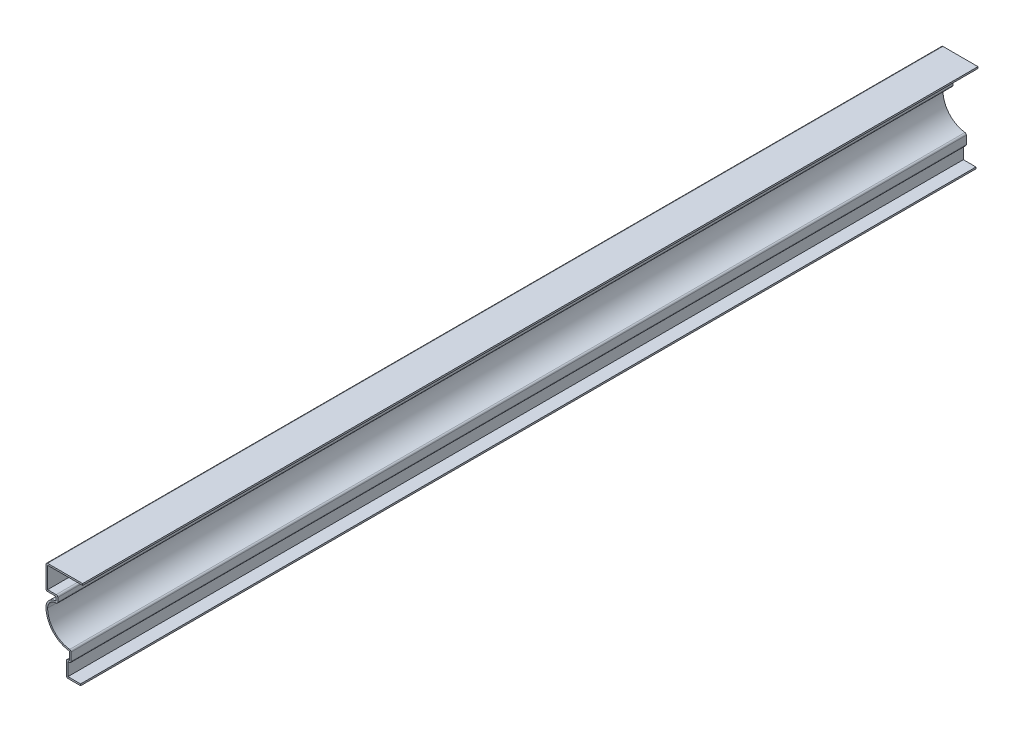
ISO-10303-21;
HEADER;
FILE_DESCRIPTION(('STEP AP214'),'2;1');
FILE_NAME('part.step','',(''),(''),'','','');
FILE_SCHEMA(('AUTOMOTIVE_DESIGN { 1 0 10303 214 1 1 1 1 }'));
ENDSEC;
DATA;
#1=APPLICATION_CONTEXT('core data for automotive mechanical design processes');
#2=APPLICATION_PROTOCOL_DEFINITION('international standard','automotive_design',2000,#1);
#3=PRODUCT_CONTEXT('',#1,'mechanical');
#4=PRODUCT('Part','Part','',(#3));
#5=PRODUCT_RELATED_PRODUCT_CATEGORY('part','',(#4));
#6=PRODUCT_DEFINITION_FORMATION('','',#4);
#7=PRODUCT_DEFINITION_CONTEXT('part definition',#1,'design');
#8=PRODUCT_DEFINITION('design','',#6,#7);
#9=PRODUCT_DEFINITION_SHAPE('','',#8);
#10=(LENGTH_UNIT() NAMED_UNIT(*) SI_UNIT(.MILLI.,.METRE.));
#11=(NAMED_UNIT(*) PLANE_ANGLE_UNIT() SI_UNIT($,.RADIAN.));
#12=(NAMED_UNIT(*) SI_UNIT($,.STERADIAN.) SOLID_ANGLE_UNIT());
#13=UNCERTAINTY_MEASURE_WITH_UNIT(LENGTH_MEASURE(1.E-05),#10,'distance_accuracy_value','');
#14=(GEOMETRIC_REPRESENTATION_CONTEXT(3) GLOBAL_UNCERTAINTY_ASSIGNED_CONTEXT((#13)) GLOBAL_UNIT_ASSIGNED_CONTEXT((#10,
#11,#12)) REPRESENTATION_CONTEXT('',''));
#15=CARTESIAN_POINT('',(0.,0.,0.));
#16=DIRECTION('',(0.,0.,1.));
#17=DIRECTION('',(1.,0.,0.));
#18=AXIS2_PLACEMENT_3D('',#15,#16,#17);
#19=CARTESIAN_POINT('',(-26.9875,68.58,-698.5));
#20=DIRECTION('',(0.,-1.,0.));
#21=DIRECTION('',(0.,0.,-1.));
#22=AXIS2_PLACEMENT_3D('',#19,#20,#21);
#23=PLANE('',#22);
#24=DIRECTION('',(1.,0.,0.));
#25=VECTOR('',#24,1.);
#26=CARTESIAN_POINT('',(-26.9875,68.58,0.));
#27=LINE('',#26,#25);
#28=CARTESIAN_POINT('',(-25.7175,68.58,0.));
#29=VERTEX_POINT('',#28);
#30=CARTESIAN_POINT('',(1.5875,68.58,0.));
#31=VERTEX_POINT('',#30);
#32=EDGE_CURVE('E318',#29,#31,#27,.T.);
#33=ORIENTED_EDGE('',*,*,#32,.F.);
#34=DIRECTION('',(0.,0.,1.));
#35=VECTOR('',#34,1.);
#36=CARTESIAN_POINT('',(-25.7175,68.58,-698.5));
#37=LINE('',#36,#35);
#38=CARTESIAN_POINT('',(-25.7175,68.58,-698.5));
#39=VERTEX_POINT('',#38);
#40=EDGE_CURVE('E265',#39,#29,#37,.T.);
#41=ORIENTED_EDGE('',*,*,#40,.F.);
#42=DIRECTION('',(1.,0.,0.));
#43=VECTOR('',#42,1.);
#44=CARTESIAN_POINT('',(-26.9875,68.58,-698.5));
#45=LINE('',#44,#43);
#46=CARTESIAN_POINT('',(1.5875,68.58,-698.5));
#47=VERTEX_POINT('',#46);
#48=EDGE_CURVE('E247',#39,#47,#45,.T.);
#49=ORIENTED_EDGE('',*,*,#48,.T.);
#50=DIRECTION('',(0.,0.,1.));
#51=VECTOR('',#50,1.);
#52=CARTESIAN_POINT('',(1.5875,68.58,-698.5));
#53=LINE('',#52,#51);
#54=EDGE_CURVE('E255',#47,#31,#53,.T.);
#55=ORIENTED_EDGE('',*,*,#54,.T.);
#56=EDGE_LOOP('',(#33,#41,#49,#55));
#57=FACE_BOUND('',#56,.T.);
#58=ADVANCED_FACE('F43',(#57),#23,.T.);
#59=CARTESIAN_POINT('',(-25.7175,50.8,-698.5));
#60=DIRECTION('',(1.,0.,0.));
#61=DIRECTION('',(0.,0.,-1.));
#62=AXIS2_PLACEMENT_3D('',#59,#60,#61);
#63=PLANE('',#62);
#64=DIRECTION('',(0.,1.,0.));
#65=VECTOR('',#64,1.);
#66=CARTESIAN_POINT('',(-25.7175,50.8,0.));
#67=LINE('',#66,#65);
#68=CARTESIAN_POINT('',(-25.7175,52.07,0.));
#69=VERTEX_POINT('',#68);
#70=EDGE_CURVE('E266',#69,#29,#67,.T.);
#71=ORIENTED_EDGE('',*,*,#70,.F.);
#72=DIRECTION('',(0.,0.,1.));
#73=VECTOR('',#72,1.);
#74=CARTESIAN_POINT('',(-25.7175,52.07,-698.5));
#75=LINE('',#74,#73);
#76=CARTESIAN_POINT('',(-25.7175,52.07,-698.5));
#77=VERTEX_POINT('',#76);
#78=EDGE_CURVE('E369',#77,#69,#75,.T.);
#79=ORIENTED_EDGE('',*,*,#78,.F.);
#80=DIRECTION('',(0.,1.,0.));
#81=VECTOR('',#80,1.);
#82=CARTESIAN_POINT('',(-25.7175,50.8,-698.5));
#83=LINE('',#82,#81);
#84=EDGE_CURVE('E263',#77,#39,#83,.T.);
#85=ORIENTED_EDGE('',*,*,#84,.T.);
#86=ORIENTED_EDGE('',*,*,#40,.T.);
#87=EDGE_LOOP('',(#71,#79,#85,#86));
#88=FACE_BOUND('',#87,.T.);
#89=ADVANCED_FACE('F488',(#88),#63,.T.);
#90=CARTESIAN_POINT('',(-19.05,52.07,-698.5));
#91=DIRECTION('',(0.,1.,0.));
#92=DIRECTION('',(0.,0.,1.));
#93=AXIS2_PLACEMENT_3D('',#90,#91,#92);
#94=PLANE('',#93);
#95=DIRECTION('',(1.,0.,0.));
#96=VECTOR('',#95,1.);
#97=CARTESIAN_POINT('',(-19.05,52.07,0.));
#98=LINE('',#97,#96);
#99=CARTESIAN_POINT('',(-19.05,52.07,0.));
#100=VERTEX_POINT('',#99);
#101=EDGE_CURVE('E269',#100,#69,#98,.F.);
#102=ORIENTED_EDGE('',*,*,#101,.F.);
#103=DIRECTION('',(0.,0.,1.));
#104=VECTOR('',#103,1.);
#105=CARTESIAN_POINT('',(-19.05,52.07,-698.5));
#106=LINE('',#105,#104);
#107=CARTESIAN_POINT('',(-19.05,52.07,-698.5));
#108=VERTEX_POINT('',#107);
#109=EDGE_CURVE('E458',#100,#108,#106,.F.);
#110=ORIENTED_EDGE('',*,*,#109,.T.);
#111=DIRECTION('',(1.,0.,0.));
#112=VECTOR('',#111,1.);
#113=CARTESIAN_POINT('',(-19.05,52.07,-698.5));
#114=LINE('',#113,#112);
#115=EDGE_CURVE('E315',#108,#77,#114,.F.);
#116=ORIENTED_EDGE('',*,*,#115,.T.);
#117=ORIENTED_EDGE('',*,*,#78,.T.);
#118=EDGE_LOOP('',(#102,#110,#116,#117));
#119=FACE_BOUND('',#118,.T.);
#120=ADVANCED_FACE('F597',(#119),#94,.T.);
#121=CARTESIAN_POINT('',(-17.78,47.625,-698.5));
#122=DIRECTION('',(1.,0.,0.));
#123=DIRECTION('',(0.,0.,-1.));
#124=AXIS2_PLACEMENT_3D('',#121,#122,#123);
#125=PLANE('',#124);
#126=DIRECTION('',(0.,1.,0.));
#127=VECTOR('',#126,1.);
#128=CARTESIAN_POINT('',(-17.78,47.625,0.));
#129=LINE('',#128,#127);
#130=CARTESIAN_POINT('',(-17.78,47.625,0.));
#131=VERTEX_POINT('',#130);
#132=CARTESIAN_POINT('',(-17.78,50.8,0.));
#133=VERTEX_POINT('',#132);
#134=EDGE_CURVE('E363',#131,#133,#129,.T.);
#135=ORIENTED_EDGE('',*,*,#134,.F.);
#136=DIRECTION('',(0.,0.,1.));
#137=VECTOR('',#136,1.);
#138=CARTESIAN_POINT('',(-17.78,47.625,-698.5));
#139=LINE('',#138,#137);
#140=CARTESIAN_POINT('',(-17.78,47.625,-698.5));
#141=VERTEX_POINT('',#140);
#142=EDGE_CURVE('E456',#131,#141,#139,.F.);
#143=ORIENTED_EDGE('',*,*,#142,.T.);
#144=DIRECTION('',(0.,1.,0.));
#145=VECTOR('',#144,1.);
#146=CARTESIAN_POINT('',(-17.78,47.625,-698.5));
#147=LINE('',#146,#145);
#148=CARTESIAN_POINT('',(-17.78,50.8,-698.5));
#149=VERTEX_POINT('',#148);
#150=EDGE_CURVE('E312',#141,#149,#147,.T.);
#151=ORIENTED_EDGE('',*,*,#150,.T.);
#152=DIRECTION('',(0.,0.,1.));
#153=VECTOR('',#152,1.);
#154=CARTESIAN_POINT('',(-17.78,50.8,-698.5));
#155=LINE('',#154,#153);
#156=EDGE_CURVE('E453',#149,#133,#155,.T.);
#157=ORIENTED_EDGE('',*,*,#156,.T.);
#158=EDGE_LOOP('',(#135,#143,#151,#157));
#159=FACE_BOUND('',#158,.T.);
#160=ADVANCED_FACE('F499',(#159),#125,.T.);
#161=CARTESIAN_POINT('',(-19.05,39.6875,-698.5));
#162=DIRECTION('',(0.,0.,1.));
#163=DIRECTION('',(1.,0.,0.));
#164=AXIS2_PLACEMENT_3D('',#161,#162,#163);
#165=CYLINDRICAL_SURFACE('',#164,6.6675);
#166=CARTESIAN_POINT('',(-19.05,39.6875,-698.5));
#167=DIRECTION('',(0.,0.,1.));
#168=DIRECTION('',(1.,0.,0.));
#169=AXIS2_PLACEMENT_3D('',#166,#167,#168);
#170=CIRCLE('',#169,6.6675);
#171=CARTESIAN_POINT('',(-25.7175,39.6875,-698.5));
#172=VERTEX_POINT('',#171);
#173=CARTESIAN_POINT('',(-19.05,46.355,-698.5));
#174=VERTEX_POINT('',#173);
#175=EDGE_CURVE('E309',#172,#174,#170,.F.);
#176=ORIENTED_EDGE('',*,*,#175,.T.);
#177=DIRECTION('',(0.,0.,1.));
#178=VECTOR('',#177,1.);
#179=CARTESIAN_POINT('',(-19.05,46.355,-698.5));
#180=LINE('',#179,#178);
#181=CARTESIAN_POINT('',(-19.05,46.355,0.));
#182=VERTEX_POINT('',#181);
#183=EDGE_CURVE('E450',#174,#182,#180,.T.);
#184=ORIENTED_EDGE('',*,*,#183,.T.);
#185=CARTESIAN_POINT('',(-19.05,39.6875,0.));
#186=DIRECTION('',(0.,0.,1.));
#187=DIRECTION('',(1.,0.,0.));
#188=AXIS2_PLACEMENT_3D('',#185,#186,#187);
#189=CIRCLE('',#188,6.6675);
#190=CARTESIAN_POINT('',(-25.7175,39.6875,0.));
#191=VERTEX_POINT('',#190);
#192=EDGE_CURVE('E360',#191,#182,#189,.F.);
#193=ORIENTED_EDGE('',*,*,#192,.F.);
#194=DIRECTION('',(0.,0.,1.));
#195=VECTOR('',#194,1.);
#196=CARTESIAN_POINT('',(-25.7175,39.6875,-698.5));
#197=LINE('',#196,#195);
#198=EDGE_CURVE('E372',#172,#191,#197,.T.);
#199=ORIENTED_EDGE('',*,*,#198,.F.);
#200=EDGE_LOOP('',(#176,#184,#193,#199));
#201=FACE_BOUND('',#200,.T.);
#202=ADVANCED_FACE('F507',(#201),#165,.F.);
#203=CARTESIAN_POINT('',(-6.19470108695653,39.6875,-698.5));
#204=DIRECTION('',(0.,0.,1.));
#205=DIRECTION('',(1.,0.,0.));
#206=AXIS2_PLACEMENT_3D('',#203,#204,#205);
#207=CYLINDRICAL_SURFACE('',#206,19.5227989130435);
#208=CARTESIAN_POINT('',(-6.19470108695653,39.6875,0.));
#209=DIRECTION('',(0.,0.,1.));
#210=DIRECTION('',(1.,0.,0.));
#211=AXIS2_PLACEMENT_3D('',#208,#209,#210);
#212=CIRCLE('',#211,19.5227989130435);
#213=CARTESIAN_POINT('',(-8.57632053941909,20.3105145228216,0.));
#214=VERTEX_POINT('',#213);
#215=EDGE_CURVE('E358',#214,#191,#212,.F.);
#216=ORIENTED_EDGE('',*,*,#215,.F.);
#217=DIRECTION('',(0.,0.,1.));
#218=VECTOR('',#217,1.);
#219=CARTESIAN_POINT('',(-8.57632053941909,20.3105145228216,-698.5));
#220=LINE('',#219,#218);
#221=CARTESIAN_POINT('',(-8.57632053941909,20.3105145228216,-698.5));
#222=VERTEX_POINT('',#221);
#223=EDGE_CURVE('E448',#214,#222,#220,.F.);
#224=ORIENTED_EDGE('',*,*,#223,.T.);
#225=CARTESIAN_POINT('',(-6.19470108695653,39.6875,-698.5));
#226=DIRECTION('',(0.,0.,1.));
#227=DIRECTION('',(1.,0.,0.));
#228=AXIS2_PLACEMENT_3D('',#225,#226,#227);
#229=CIRCLE('',#228,19.5227989130435);
#230=EDGE_CURVE('E307',#222,#172,#229,.F.);
#231=ORIENTED_EDGE('',*,*,#230,.T.);
#232=ORIENTED_EDGE('',*,*,#198,.T.);
#233=EDGE_LOOP('',(#216,#224,#231,#232));
#234=FACE_BOUND('',#233,.T.);
#235=ADVANCED_FACE('F747',(#234),#207,.F.);
#236=CARTESIAN_POINT('',(-7.46125,12.7,-698.5));
#237=DIRECTION('',(1.,0.,0.));
#238=DIRECTION('',(0.,0.,-1.));
#239=AXIS2_PLACEMENT_3D('',#236,#237,#238);
#240=PLANE('',#239);
#241=DIRECTION('',(0.,1.,0.));
#242=VECTOR('',#241,1.);
#243=CARTESIAN_POINT('',(-7.46125,12.7,0.));
#244=LINE('',#243,#242);
#245=CARTESIAN_POINT('',(-7.46125,12.7,0.));
#246=VERTEX_POINT('',#245);
#247=CARTESIAN_POINT('',(-7.46125,19.05,0.));
#248=VERTEX_POINT('',#247);
#249=EDGE_CURVE('E355',#246,#248,#244,.T.);
#250=ORIENTED_EDGE('',*,*,#249,.F.);
#251=DIRECTION('',(0.,0.,1.));
#252=VECTOR('',#251,1.);
#253=CARTESIAN_POINT('',(-7.46125,12.7,-698.5));
#254=LINE('',#253,#252);
#255=CARTESIAN_POINT('',(-7.46125,12.7,-698.5));
#256=VERTEX_POINT('',#255);
#257=EDGE_CURVE('E446',#246,#256,#254,.F.);
#258=ORIENTED_EDGE('',*,*,#257,.T.);
#259=DIRECTION('',(0.,1.,0.));
#260=VECTOR('',#259,1.);
#261=CARTESIAN_POINT('',(-7.46125,12.7,-698.5));
#262=LINE('',#261,#260);
#263=CARTESIAN_POINT('',(-7.46125,19.05,-698.5));
#264=VERTEX_POINT('',#263);
#265=EDGE_CURVE('E304',#256,#264,#262,.T.);
#266=ORIENTED_EDGE('',*,*,#265,.T.);
#267=DIRECTION('',(0.,0.,1.));
#268=VECTOR('',#267,1.);
#269=CARTESIAN_POINT('',(-7.46125,19.05,-698.5));
#270=LINE('',#269,#268);
#271=EDGE_CURVE('E443',#264,#248,#270,.T.);
#272=ORIENTED_EDGE('',*,*,#271,.T.);
#273=EDGE_LOOP('',(#250,#258,#266,#272));
#274=FACE_BOUND('',#273,.T.);
#275=ADVANCED_FACE('F520',(#274),#240,.T.);
#276=CARTESIAN_POINT('',(-11.1125,11.43,-698.5));
#277=DIRECTION('',(0.,-1.,0.));
#278=DIRECTION('',(0.,0.,-1.));
#279=AXIS2_PLACEMENT_3D('',#276,#277,#278);
#280=PLANE('',#279);
#281=DIRECTION('',(1.,0.,0.));
#282=VECTOR('',#281,1.);
#283=CARTESIAN_POINT('',(-11.1125,11.43,-698.5));
#284=LINE('',#283,#282);
#285=CARTESIAN_POINT('',(-9.8425,11.43,-698.5));
#286=VERTEX_POINT('',#285);
#287=CARTESIAN_POINT('',(-8.73125,11.43,-698.5));
#288=VERTEX_POINT('',#287);
#289=EDGE_CURVE('E301',#286,#288,#284,.T.);
#290=ORIENTED_EDGE('',*,*,#289,.T.);
#291=DIRECTION('',(0.,0.,1.));
#292=VECTOR('',#291,1.);
#293=CARTESIAN_POINT('',(-8.73125,11.43,-698.5));
#294=LINE('',#293,#292);
#295=CARTESIAN_POINT('',(-8.73125,11.43,0.));
#296=VERTEX_POINT('',#295);
#297=EDGE_CURVE('E440',#288,#296,#294,.T.);
#298=ORIENTED_EDGE('',*,*,#297,.T.);
#299=DIRECTION('',(1.,0.,0.));
#300=VECTOR('',#299,1.);
#301=CARTESIAN_POINT('',(-11.1125,11.43,0.));
#302=LINE('',#301,#300);
#303=CARTESIAN_POINT('',(-9.8425,11.43,0.));
#304=VERTEX_POINT('',#303);
#305=EDGE_CURVE('E352',#304,#296,#302,.T.);
#306=ORIENTED_EDGE('',*,*,#305,.F.);
#307=DIRECTION('',(0.,0.,1.));
#308=VECTOR('',#307,1.);
#309=CARTESIAN_POINT('',(-9.8425,11.43,-698.5));
#310=LINE('',#309,#308);
#311=EDGE_CURVE('E375',#286,#304,#310,.T.);
#312=ORIENTED_EDGE('',*,*,#311,.F.);
#313=EDGE_LOOP('',(#290,#298,#306,#312));
#314=FACE_BOUND('',#313,.T.);
#315=ADVANCED_FACE('F529',(#314),#280,.T.);
#316=CARTESIAN_POINT('',(-9.8425,0.,-698.5));
#317=DIRECTION('',(1.,0.,0.));
#318=DIRECTION('',(0.,0.,-1.));
#319=AXIS2_PLACEMENT_3D('',#316,#317,#318);
#320=PLANE('',#319);
#321=DIRECTION('',(0.,1.,0.));
#322=VECTOR('',#321,1.);
#323=CARTESIAN_POINT('',(-9.8425,0.,0.));
#324=LINE('',#323,#322);
#325=CARTESIAN_POINT('',(-9.8425,1.27,0.));
#326=VERTEX_POINT('',#325);
#327=EDGE_CURVE('E349',#326,#304,#324,.T.);
#328=ORIENTED_EDGE('',*,*,#327,.F.);
#329=DIRECTION('',(0.,0.,1.));
#330=VECTOR('',#329,1.);
#331=CARTESIAN_POINT('',(-9.8425,1.27,-698.5));
#332=LINE('',#331,#330);
#333=CARTESIAN_POINT('',(-9.8425,1.27,-698.5));
#334=VERTEX_POINT('',#333);
#335=EDGE_CURVE('E377',#334,#326,#332,.T.);
#336=ORIENTED_EDGE('',*,*,#335,.F.);
#337=DIRECTION('',(0.,1.,0.));
#338=VECTOR('',#337,1.);
#339=CARTESIAN_POINT('',(-9.8425,0.,-698.5));
#340=LINE('',#339,#338);
#341=EDGE_CURVE('E298',#334,#286,#340,.T.);
#342=ORIENTED_EDGE('',*,*,#341,.T.);
#343=ORIENTED_EDGE('',*,*,#311,.T.);
#344=EDGE_LOOP('',(#328,#336,#342,#343));
#345=FACE_BOUND('',#344,.T.);
#346=ADVANCED_FACE('F535',(#345),#320,.T.);
#347=CARTESIAN_POINT('',(0.,1.27,-698.5));
#348=DIRECTION('',(0.,1.,0.));
#349=DIRECTION('',(0.,0.,1.));
#350=AXIS2_PLACEMENT_3D('',#347,#348,#349);
#351=PLANE('',#350);
#352=DIRECTION('',(1.,0.,0.));
#353=VECTOR('',#352,1.);
#354=CARTESIAN_POINT('',(0.,1.27,0.));
#355=LINE('',#354,#353);
#356=CARTESIAN_POINT('',(0.,1.27,0.));
#357=VERTEX_POINT('',#356);
#358=EDGE_CURVE('E346',#357,#326,#355,.F.);
#359=ORIENTED_EDGE('',*,*,#358,.F.);
#360=DIRECTION('',(0.,0.,1.));
#361=VECTOR('',#360,1.);
#362=CARTESIAN_POINT('',(0.,1.27,-698.5));
#363=LINE('',#362,#361);
#364=CARTESIAN_POINT('',(0.,1.27,-698.5));
#365=VERTEX_POINT('',#364);
#366=EDGE_CURVE('E379',#365,#357,#363,.T.);
#367=ORIENTED_EDGE('',*,*,#366,.F.);
#368=DIRECTION('',(1.,0.,0.));
#369=VECTOR('',#368,1.);
#370=CARTESIAN_POINT('',(0.,1.27,-698.5));
#371=LINE('',#370,#369);
#372=EDGE_CURVE('E295',#365,#334,#371,.F.);
#373=ORIENTED_EDGE('',*,*,#372,.T.);
#374=ORIENTED_EDGE('',*,*,#335,.T.);
#375=EDGE_LOOP('',(#359,#367,#373,#374));
#376=FACE_BOUND('',#375,.T.);
#377=ADVANCED_FACE('F538',(#376),#351,.T.);
#378=CARTESIAN_POINT('',(0.,1.27,-698.5));
#379=DIRECTION('',(-1.,0.,0.));
#380=DIRECTION('',(0.,0.,1.));
#381=AXIS2_PLACEMENT_3D('',#378,#379,#380);
#382=PLANE('',#381);
#383=DIRECTION('',(0.,-1.,0.));
#384=VECTOR('',#383,1.);
#385=CARTESIAN_POINT('',(0.,1.27,0.));
#386=LINE('',#385,#384);
#387=CARTESIAN_POINT('',(0.,0.,0.));
#388=VERTEX_POINT('',#387);
#389=EDGE_CURVE('E344',#357,#388,#386,.T.);
#390=ORIENTED_EDGE('',*,*,#389,.T.);
#391=DIRECTION('',(0.,0.,1.));
#392=VECTOR('',#391,1.);
#393=CARTESIAN_POINT('',(0.,0.,-698.5));
#394=LINE('',#393,#392);
#395=CARTESIAN_POINT('',(0.,0.,-698.5));
#396=VERTEX_POINT('',#395);
#397=EDGE_CURVE('E381',#396,#388,#394,.T.);
#398=ORIENTED_EDGE('',*,*,#397,.F.);
#399=DIRECTION('',(0.,-1.,0.));
#400=VECTOR('',#399,1.);
#401=CARTESIAN_POINT('',(0.,1.27,-698.5));
#402=LINE('',#401,#400);
#403=EDGE_CURVE('E293',#365,#396,#402,.T.);
#404=ORIENTED_EDGE('',*,*,#403,.F.);
#405=ORIENTED_EDGE('',*,*,#366,.T.);
#406=EDGE_LOOP('',(#390,#398,#404,#405));
#407=FACE_BOUND('',#406,.T.);
#408=ADVANCED_FACE('F544',(#407),#382,.F.);
#409=CARTESIAN_POINT('',(0.,0.,-698.5));
#410=DIRECTION('',(0.,1.,0.));
#411=DIRECTION('',(0.,0.,1.));
#412=AXIS2_PLACEMENT_3D('',#409,#410,#411);
#413=PLANE('',#412);
#414=DIRECTION('',(-1.,0.,0.));
#415=VECTOR('',#414,1.);
#416=CARTESIAN_POINT('',(0.,0.,0.));
#417=LINE('',#416,#415);
#418=CARTESIAN_POINT('',(-9.8425,0.,0.));
#419=VERTEX_POINT('',#418);
#420=EDGE_CURVE('E341',#388,#419,#417,.T.);
#421=ORIENTED_EDGE('',*,*,#420,.T.);
#422=DIRECTION('',(0.,0.,1.));
#423=VECTOR('',#422,1.);
#424=CARTESIAN_POINT('',(-9.8425,0.,-698.5));
#425=LINE('',#424,#423);
#426=CARTESIAN_POINT('',(-9.8425,0.,-698.5));
#427=VERTEX_POINT('',#426);
#428=EDGE_CURVE('E420',#419,#427,#425,.F.);
#429=ORIENTED_EDGE('',*,*,#428,.T.);
#430=DIRECTION('',(-1.,0.,0.));
#431=VECTOR('',#430,1.);
#432=CARTESIAN_POINT('',(0.,0.,-698.5));
#433=LINE('',#432,#431);
#434=EDGE_CURVE('E291',#396,#427,#433,.T.);
#435=ORIENTED_EDGE('',*,*,#434,.F.);
#436=ORIENTED_EDGE('',*,*,#397,.T.);
#437=EDGE_LOOP('',(#421,#429,#435,#436));
#438=FACE_BOUND('',#437,.T.);
#439=ADVANCED_FACE('F548',(#438),#413,.F.);
#440=CARTESIAN_POINT('',(-11.1125,0.,-698.5));
#441=DIRECTION('',(1.,0.,0.));
#442=DIRECTION('',(0.,0.,-1.));
#443=AXIS2_PLACEMENT_3D('',#440,#441,#442);
#444=PLANE('',#443);
#445=DIRECTION('',(0.,1.,0.));
#446=VECTOR('',#445,1.);
#447=CARTESIAN_POINT('',(-11.1125,0.,-698.5));
#448=LINE('',#447,#446);
#449=CARTESIAN_POINT('',(-11.1125,1.27,-698.5));
#450=VERTEX_POINT('',#449);
#451=CARTESIAN_POINT('',(-11.1125,11.43,-698.5));
#452=VERTEX_POINT('',#451);
#453=EDGE_CURVE('E288',#450,#452,#448,.T.);
#454=ORIENTED_EDGE('',*,*,#453,.F.);
#455=DIRECTION('',(0.,0.,1.));
#456=VECTOR('',#455,1.);
#457=CARTESIAN_POINT('',(-11.1125,1.27,-698.5));
#458=LINE('',#457,#456);
#459=CARTESIAN_POINT('',(-11.1125,1.27,0.));
#460=VERTEX_POINT('',#459);
#461=EDGE_CURVE('E401',#450,#460,#458,.T.);
#462=ORIENTED_EDGE('',*,*,#461,.T.);
#463=DIRECTION('',(0.,1.,0.));
#464=VECTOR('',#463,1.);
#465=CARTESIAN_POINT('',(-11.1125,0.,0.));
#466=LINE('',#465,#464);
#467=CARTESIAN_POINT('',(-11.1125,11.43,0.));
#468=VERTEX_POINT('',#467);
#469=EDGE_CURVE('E338',#460,#468,#466,.T.);
#470=ORIENTED_EDGE('',*,*,#469,.T.);
#471=DIRECTION('',(0.,0.,1.));
#472=VECTOR('',#471,1.);
#473=CARTESIAN_POINT('',(-11.1125,11.43,-698.5));
#474=LINE('',#473,#472);
#475=EDGE_CURVE('E368',#468,#452,#474,.F.);
#476=ORIENTED_EDGE('',*,*,#475,.T.);
#477=EDGE_LOOP('',(#454,#462,#470,#476));
#478=FACE_BOUND('',#477,.T.);
#479=ADVANCED_FACE('F556',(#478),#444,.F.);
#480=CARTESIAN_POINT('',(-11.1125,12.7,-698.5));
#481=DIRECTION('',(0.,-1.,0.));
#482=DIRECTION('',(0.,0.,-1.));
#483=AXIS2_PLACEMENT_3D('',#480,#481,#482);
#484=PLANE('',#483);
#485=DIRECTION('',(1.,0.,0.));
#486=VECTOR('',#485,1.);
#487=CARTESIAN_POINT('',(-11.1125,12.7,-698.5));
#488=LINE('',#487,#486);
#489=CARTESIAN_POINT('',(-9.8425,12.7,-698.5));
#490=VERTEX_POINT('',#489);
#491=CARTESIAN_POINT('',(-8.73125,12.7,-698.5));
#492=VERTEX_POINT('',#491);
#493=EDGE_CURVE('E286',#490,#492,#488,.T.);
#494=ORIENTED_EDGE('',*,*,#493,.F.);
#495=DIRECTION('',(0.,0.,1.));
#496=VECTOR('',#495,1.);
#497=CARTESIAN_POINT('',(-9.8425,12.7,-698.5));
#498=LINE('',#497,#496);
#499=CARTESIAN_POINT('',(-9.8425,12.7,0.));
#500=VERTEX_POINT('',#499);
#501=EDGE_CURVE('E437',#490,#500,#498,.T.);
#502=ORIENTED_EDGE('',*,*,#501,.T.);
#503=DIRECTION('',(1.,0.,0.));
#504=VECTOR('',#503,1.);
#505=CARTESIAN_POINT('',(-11.1125,12.7,0.));
#506=LINE('',#505,#504);
#507=CARTESIAN_POINT('',(-8.73125,12.7,0.));
#508=VERTEX_POINT('',#507);
#509=EDGE_CURVE('E336',#500,#508,#506,.T.);
#510=ORIENTED_EDGE('',*,*,#509,.T.);
#511=DIRECTION('',(0.,0.,1.));
#512=VECTOR('',#511,1.);
#513=CARTESIAN_POINT('',(-8.73125,12.7,-698.5));
#514=LINE('',#513,#512);
#515=EDGE_CURVE('E384',#492,#508,#514,.T.);
#516=ORIENTED_EDGE('',*,*,#515,.F.);
#517=EDGE_LOOP('',(#494,#502,#510,#516));
#518=FACE_BOUND('',#517,.T.);
#519=ADVANCED_FACE('F564',(#518),#484,.F.);
#520=CARTESIAN_POINT('',(-8.73125,12.7,-698.5));
#521=DIRECTION('',(1.,0.,0.));
#522=DIRECTION('',(0.,0.,-1.));
#523=AXIS2_PLACEMENT_3D('',#520,#521,#522);
#524=PLANE('',#523);
#525=DIRECTION('',(0.,1.,0.));
#526=VECTOR('',#525,1.);
#527=CARTESIAN_POINT('',(-8.73125,12.7,0.));
#528=LINE('',#527,#526);
#529=CARTESIAN_POINT('',(-8.73125,19.05,0.));
#530=VERTEX_POINT('',#529);
#531=EDGE_CURVE('E334',#508,#530,#528,.T.);
#532=ORIENTED_EDGE('',*,*,#531,.T.);
#533=DIRECTION('',(0.,0.,1.));
#534=VECTOR('',#533,1.);
#535=CARTESIAN_POINT('',(-8.73125,19.05,-698.5));
#536=LINE('',#535,#534);
#537=CARTESIAN_POINT('',(-8.73125,19.05,-698.5));
#538=VERTEX_POINT('',#537);
#539=EDGE_CURVE('E387',#538,#530,#536,.T.);
#540=ORIENTED_EDGE('',*,*,#539,.F.);
#541=DIRECTION('',(0.,1.,0.));
#542=VECTOR('',#541,1.);
#543=CARTESIAN_POINT('',(-8.73125,12.7,-698.5));
#544=LINE('',#543,#542);
#545=EDGE_CURVE('E284',#492,#538,#544,.T.);
#546=ORIENTED_EDGE('',*,*,#545,.F.);
#547=ORIENTED_EDGE('',*,*,#515,.T.);
#548=EDGE_LOOP('',(#532,#540,#546,#547));
#549=FACE_BOUND('',#548,.T.);
#550=ADVANCED_FACE('F570',(#549),#524,.F.);
#551=CARTESIAN_POINT('',(-6.19470108695653,39.6875,-698.5));
#552=DIRECTION('',(0.,0.,1.));
#553=DIRECTION('',(1.,0.,0.));
#554=AXIS2_PLACEMENT_3D('',#551,#552,#553);
#555=CYLINDRICAL_SURFACE('',#554,20.7927989130435);
#556=CARTESIAN_POINT('',(-6.19470108695653,39.6875,0.));
#557=DIRECTION('',(0.,0.,-1.));
#558=DIRECTION('',(1.,0.,0.));
#559=AXIS2_PLACEMENT_3D('',#556,#557,#558);
#560=CIRCLE('',#559,20.7927989130435);
#561=CARTESIAN_POINT('',(-26.9875,39.6875,0.));
#562=VERTEX_POINT('',#561);
#563=EDGE_CURVE('E332',#530,#562,#560,.T.);
#564=ORIENTED_EDGE('',*,*,#563,.T.);
#565=DIRECTION('',(0.,0.,1.));
#566=VECTOR('',#565,1.);
#567=CARTESIAN_POINT('',(-26.9875,39.6875,-698.5));
#568=LINE('',#567,#566);
#569=CARTESIAN_POINT('',(-26.9875,39.6875,-698.5));
#570=VERTEX_POINT('',#569);
#571=EDGE_CURVE('E390',#570,#562,#568,.T.);
#572=ORIENTED_EDGE('',*,*,#571,.F.);
#573=CARTESIAN_POINT('',(-6.19470108695653,39.6875,-698.5));
#574=DIRECTION('',(0.,0.,-1.));
#575=DIRECTION('',(1.,0.,0.));
#576=AXIS2_PLACEMENT_3D('',#573,#574,#575);
#577=CIRCLE('',#576,20.7927989130435);
#578=EDGE_CURVE('E282',#538,#570,#577,.T.);
#579=ORIENTED_EDGE('',*,*,#578,.F.);
#580=ORIENTED_EDGE('',*,*,#539,.T.);
#581=EDGE_LOOP('',(#564,#572,#579,#580));
#582=FACE_BOUND('',#581,.T.);
#583=ADVANCED_FACE('F576',(#582),#555,.T.);
#584=CARTESIAN_POINT('',(-19.05,39.6875,-698.5));
#585=DIRECTION('',(0.,0.,1.));
#586=DIRECTION('',(1.,0.,0.));
#587=AXIS2_PLACEMENT_3D('',#584,#585,#586);
#588=CYLINDRICAL_SURFACE('',#587,7.9375);
#589=CARTESIAN_POINT('',(-19.05,39.6875,0.));
#590=DIRECTION('',(0.,0.,-1.));
#591=DIRECTION('',(-1.,0.,0.));
#592=AXIS2_PLACEMENT_3D('',#589,#590,#591);
#593=CIRCLE('',#592,7.9375);
#594=CARTESIAN_POINT('',(-19.05,47.625,0.));
#595=VERTEX_POINT('',#594);
#596=EDGE_CURVE('E330',#562,#595,#593,.T.);
#597=ORIENTED_EDGE('',*,*,#596,.T.);
#598=DIRECTION('',(0.,0.,1.));
#599=VECTOR('',#598,1.);
#600=CARTESIAN_POINT('',(-19.05,47.625,-698.5));
#601=LINE('',#600,#599);
#602=CARTESIAN_POINT('',(-19.05,47.625,-698.5));
#603=VERTEX_POINT('',#602);
#604=EDGE_CURVE('E393',#603,#595,#601,.T.);
#605=ORIENTED_EDGE('',*,*,#604,.F.);
#606=CARTESIAN_POINT('',(-19.05,39.6875,-698.5));
#607=DIRECTION('',(0.,0.,-1.));
#608=DIRECTION('',(-1.,0.,0.));
#609=AXIS2_PLACEMENT_3D('',#606,#607,#608);
#610=CIRCLE('',#609,7.9375);
#611=EDGE_CURVE('E280',#570,#603,#610,.T.);
#612=ORIENTED_EDGE('',*,*,#611,.F.);
#613=ORIENTED_EDGE('',*,*,#571,.T.);
#614=EDGE_LOOP('',(#597,#605,#612,#613));
#615=FACE_BOUND('',#614,.T.);
#616=ADVANCED_FACE('F580',(#615),#588,.T.);
#617=CARTESIAN_POINT('',(-19.05,47.625,-698.5));
#618=DIRECTION('',(1.,0.,0.));
#619=DIRECTION('',(0.,0.,-1.));
#620=AXIS2_PLACEMENT_3D('',#617,#618,#619);
#621=PLANE('',#620);
#622=DIRECTION('',(0.,1.,0.));
#623=VECTOR('',#622,1.);
#624=CARTESIAN_POINT('',(-19.05,47.625,0.));
#625=LINE('',#624,#623);
#626=CARTESIAN_POINT('',(-19.05,50.8,0.));
#627=VERTEX_POINT('',#626);
#628=EDGE_CURVE('E328',#595,#627,#625,.T.);
#629=ORIENTED_EDGE('',*,*,#628,.T.);
#630=DIRECTION('',(0.,0.,1.));
#631=VECTOR('',#630,1.);
#632=CARTESIAN_POINT('',(-19.05,50.8,-698.5));
#633=LINE('',#632,#631);
#634=CARTESIAN_POINT('',(-19.05,50.8,-698.5));
#635=VERTEX_POINT('',#634);
#636=EDGE_CURVE('E396',#635,#627,#633,.T.);
#637=ORIENTED_EDGE('',*,*,#636,.F.);
#638=DIRECTION('',(0.,1.,0.));
#639=VECTOR('',#638,1.);
#640=CARTESIAN_POINT('',(-19.05,47.625,-698.5));
#641=LINE('',#640,#639);
#642=EDGE_CURVE('E278',#603,#635,#641,.T.);
#643=ORIENTED_EDGE('',*,*,#642,.F.);
#644=ORIENTED_EDGE('',*,*,#604,.T.);
#645=EDGE_LOOP('',(#629,#637,#643,#644));
#646=FACE_BOUND('',#645,.T.);
#647=ADVANCED_FACE('F583',(#646),#621,.F.);
#648=CARTESIAN_POINT('',(-19.05,50.8,-698.5));
#649=DIRECTION('',(0.,1.,0.));
#650=DIRECTION('',(0.,0.,1.));
#651=AXIS2_PLACEMENT_3D('',#648,#649,#650);
#652=PLANE('',#651);
#653=DIRECTION('',(-1.,0.,0.));
#654=VECTOR('',#653,1.);
#655=CARTESIAN_POINT('',(-19.05,50.8,0.));
#656=LINE('',#655,#654);
#657=CARTESIAN_POINT('',(-25.7175,50.8,0.));
#658=VERTEX_POINT('',#657);
#659=EDGE_CURVE('E325',#627,#658,#656,.T.);
#660=ORIENTED_EDGE('',*,*,#659,.T.);
#661=DIRECTION('',(0.,0.,1.));
#662=VECTOR('',#661,1.);
#663=CARTESIAN_POINT('',(-25.7175,50.8,-698.5));
#664=LINE('',#663,#662);
#665=CARTESIAN_POINT('',(-25.7175,50.8,-698.5));
#666=VERTEX_POINT('',#665);
#667=EDGE_CURVE('E51',#658,#666,#664,.F.);
#668=ORIENTED_EDGE('',*,*,#667,.T.);
#669=DIRECTION('',(-1.,0.,0.));
#670=VECTOR('',#669,1.);
#671=CARTESIAN_POINT('',(-19.05,50.8,-698.5));
#672=LINE('',#671,#670);
#673=EDGE_CURVE('E275',#635,#666,#672,.T.);
#674=ORIENTED_EDGE('',*,*,#673,.F.);
#675=ORIENTED_EDGE('',*,*,#636,.T.);
#676=EDGE_LOOP('',(#660,#668,#674,#675));
#677=FACE_BOUND('',#676,.T.);
#678=ADVANCED_FACE('F466',(#677),#652,.F.);
#679=CARTESIAN_POINT('',(-26.9875,50.8,-698.5));
#680=DIRECTION('',(1.,0.,0.));
#681=DIRECTION('',(0.,0.,-1.));
#682=AXIS2_PLACEMENT_3D('',#679,#680,#681);
#683=PLANE('',#682);
#684=DIRECTION('',(0.,1.,0.));
#685=VECTOR('',#684,1.);
#686=CARTESIAN_POINT('',(-26.9875,50.8,-698.5));
#687=LINE('',#686,#685);
#688=CARTESIAN_POINT('',(-26.9875,52.07,-698.5));
#689=VERTEX_POINT('',#688);
#690=CARTESIAN_POINT('',(-26.9875,68.58,-698.5));
#691=VERTEX_POINT('',#690);
#692=EDGE_CURVE('E273',#689,#691,#687,.T.);
#693=ORIENTED_EDGE('',*,*,#692,.F.);
#694=DIRECTION('',(0.,0.,1.));
#695=VECTOR('',#694,1.);
#696=CARTESIAN_POINT('',(-26.9875,52.07,-698.5));
#697=LINE('',#696,#695);
#698=CARTESIAN_POINT('',(-26.9875,52.07,0.));
#699=VERTEX_POINT('',#698);
#700=EDGE_CURVE('E461',#689,#699,#697,.T.);
#701=ORIENTED_EDGE('',*,*,#700,.T.);
#702=DIRECTION('',(0.,1.,0.));
#703=VECTOR('',#702,1.);
#704=CARTESIAN_POINT('',(-26.9875,50.8,0.));
#705=LINE('',#704,#703);
#706=CARTESIAN_POINT('',(-26.9875,68.58,0.));
#707=VERTEX_POINT('',#706);
#708=EDGE_CURVE('E323',#699,#707,#705,.T.);
#709=ORIENTED_EDGE('',*,*,#708,.T.);
#710=DIRECTION('',(0.,0.,1.));
#711=VECTOR('',#710,1.);
#712=CARTESIAN_POINT('',(-26.9875,68.58,-698.5));
#713=LINE('',#712,#711);
#714=EDGE_CURVE('E66',#707,#691,#713,.F.);
#715=ORIENTED_EDGE('',*,*,#714,.T.);
#716=EDGE_LOOP('',(#693,#701,#709,#715));
#717=FACE_BOUND('',#716,.T.);
#718=ADVANCED_FACE('F475',(#717),#683,.F.);
#719=CARTESIAN_POINT('',(-26.9875,69.85,-698.5));
#720=DIRECTION('',(0.,-1.,0.));
#721=DIRECTION('',(0.,0.,-1.));
#722=AXIS2_PLACEMENT_3D('',#719,#720,#721);
#723=PLANE('',#722);
#724=DIRECTION('',(1.,0.,0.));
#725=VECTOR('',#724,1.);
#726=CARTESIAN_POINT('',(-26.9875,69.85,-698.5));
#727=LINE('',#726,#725);
#728=CARTESIAN_POINT('',(-25.7175,69.85,-698.5));
#729=VERTEX_POINT('',#728);
#730=CARTESIAN_POINT('',(1.5875,69.85,-698.5));
#731=VERTEX_POINT('',#730);
#732=EDGE_CURVE('E249',#729,#731,#727,.T.);
#733=ORIENTED_EDGE('',*,*,#732,.F.);
#734=DIRECTION('',(0.,0.,1.));
#735=VECTOR('',#734,1.);
#736=CARTESIAN_POINT('',(-25.7175,69.85,-698.5));
#737=LINE('',#736,#735);
#738=CARTESIAN_POINT('',(-25.7175,69.85,0.));
#739=VERTEX_POINT('',#738);
#740=EDGE_CURVE('E11',#729,#739,#737,.T.);
#741=ORIENTED_EDGE('',*,*,#740,.T.);
#742=DIRECTION('',(1.,0.,0.));
#743=VECTOR('',#742,1.);
#744=CARTESIAN_POINT('',(-26.9875,69.85,0.));
#745=LINE('',#744,#743);
#746=CARTESIAN_POINT('',(1.5875,69.85,0.));
#747=VERTEX_POINT('',#746);
#748=EDGE_CURVE('E321',#739,#747,#745,.T.);
#749=ORIENTED_EDGE('',*,*,#748,.T.);
#750=DIRECTION('',(0.,0.,1.));
#751=VECTOR('',#750,1.);
#752=CARTESIAN_POINT('',(1.5875,69.85,-698.5));
#753=LINE('',#752,#751);
#754=EDGE_CURVE('E262',#731,#747,#753,.T.);
#755=ORIENTED_EDGE('',*,*,#754,.F.);
#756=EDGE_LOOP('',(#733,#741,#749,#755));
#757=FACE_BOUND('',#756,.T.);
#758=ADVANCED_FACE('F483',(#757),#723,.F.);
#759=CARTESIAN_POINT('',(1.5875,69.85,-698.5));
#760=DIRECTION('',(-1.,0.,0.));
#761=DIRECTION('',(0.,0.,1.));
#762=AXIS2_PLACEMENT_3D('',#759,#760,#761);
#763=PLANE('',#762);
#764=DIRECTION('',(0.,-1.,0.));
#765=VECTOR('',#764,1.);
#766=CARTESIAN_POINT('',(1.5875,69.85,0.));
#767=LINE('',#766,#765);
#768=EDGE_CURVE('E258',#747,#31,#767,.T.);
#769=ORIENTED_EDGE('',*,*,#768,.T.);
#770=ORIENTED_EDGE('',*,*,#54,.F.);
#771=DIRECTION('',(0.,-1.,0.));
#772=VECTOR('',#771,1.);
#773=CARTESIAN_POINT('',(1.5875,69.85,-698.5));
#774=LINE('',#773,#772);
#775=EDGE_CURVE('E241',#731,#47,#774,.T.);
#776=ORIENTED_EDGE('',*,*,#775,.F.);
#777=ORIENTED_EDGE('',*,*,#754,.T.);
#778=EDGE_LOOP('',(#769,#770,#776,#777));
#779=FACE_BOUND('',#778,.T.);
#780=ADVANCED_FACE('F256',(#779),#763,.F.);
#781=CARTESIAN_POINT('',(-19.05,39.6875,-698.5));
#782=DIRECTION('',(0.,0.,-1.));
#783=DIRECTION('',(-1.,0.,0.));
#784=AXIS2_PLACEMENT_3D('',#781,#782,#783);
#785=PLANE('',#784);
#786=ORIENTED_EDGE('',*,*,#434,.T.);
#787=CARTESIAN_POINT('',(-9.8425,1.27,-698.5));
#788=DIRECTION('',(0.,0.,-1.));
#789=DIRECTION('',(-1.,0.,0.));
#790=AXIS2_PLACEMENT_3D('',#787,#788,#789);
#791=CIRCLE('',#790,1.27);
#792=EDGE_CURVE('E435',#427,#450,#791,.T.);
#793=ORIENTED_EDGE('',*,*,#792,.T.);
#794=ORIENTED_EDGE('',*,*,#453,.T.);
#795=CARTESIAN_POINT('',(-9.8425,11.43,-698.5));
#796=DIRECTION('',(0.,0.,-1.));
#797=DIRECTION('',(-1.,0.,0.));
#798=AXIS2_PLACEMENT_3D('',#795,#796,#797);
#799=CIRCLE('',#798,1.27);
#800=EDGE_CURVE('E433',#452,#490,#799,.T.);
#801=ORIENTED_EDGE('',*,*,#800,.T.);
#802=ORIENTED_EDGE('',*,*,#493,.T.);
#803=ORIENTED_EDGE('',*,*,#545,.T.);
#804=ORIENTED_EDGE('',*,*,#578,.T.);
#805=ORIENTED_EDGE('',*,*,#611,.T.);
#806=ORIENTED_EDGE('',*,*,#642,.T.);
#807=ORIENTED_EDGE('',*,*,#673,.T.);
#808=CARTESIAN_POINT('',(-25.7175,52.07,-698.5));
#809=DIRECTION('',(0.,0.,-1.));
#810=DIRECTION('',(-1.,0.,0.));
#811=AXIS2_PLACEMENT_3D('',#808,#809,#810);
#812=CIRCLE('',#811,1.27);
#813=EDGE_CURVE('E423',#666,#689,#812,.T.);
#814=ORIENTED_EDGE('',*,*,#813,.T.);
#815=ORIENTED_EDGE('',*,*,#692,.T.);
#816=CARTESIAN_POINT('',(-25.7175,68.58,-698.5));
#817=DIRECTION('',(0.,0.,-1.));
#818=DIRECTION('',(-1.,0.,0.));
#819=AXIS2_PLACEMENT_3D('',#816,#817,#818);
#820=CIRCLE('',#819,1.27);
#821=EDGE_CURVE('E58',#691,#729,#820,.T.);
#822=ORIENTED_EDGE('',*,*,#821,.T.);
#823=ORIENTED_EDGE('',*,*,#732,.T.);
#824=ORIENTED_EDGE('',*,*,#775,.T.);
#825=ORIENTED_EDGE('',*,*,#48,.F.);
#826=ORIENTED_EDGE('',*,*,#84,.F.);
#827=ORIENTED_EDGE('',*,*,#115,.F.);
#828=CARTESIAN_POINT('',(-19.05,50.8,-698.5));
#829=DIRECTION('',(0.,0.,-1.));
#830=DIRECTION('',(-1.,0.,0.));
#831=AXIS2_PLACEMENT_3D('',#828,#829,#830);
#832=CIRCLE('',#831,1.27);
#833=EDGE_CURVE('E425',#108,#149,#832,.T.);
#834=ORIENTED_EDGE('',*,*,#833,.T.);
#835=ORIENTED_EDGE('',*,*,#150,.F.);
#836=CARTESIAN_POINT('',(-19.05,47.625,-698.5));
#837=DIRECTION('',(0.,0.,-1.));
#838=DIRECTION('',(-1.,0.,0.));
#839=AXIS2_PLACEMENT_3D('',#836,#837,#838);
#840=CIRCLE('',#839,1.27);
#841=EDGE_CURVE('E427',#141,#174,#840,.T.);
#842=ORIENTED_EDGE('',*,*,#841,.T.);
#843=ORIENTED_EDGE('',*,*,#175,.F.);
#844=ORIENTED_EDGE('',*,*,#230,.F.);
#845=CARTESIAN_POINT('',(-8.73125,19.05,-698.5));
#846=DIRECTION('',(0.,0.,-1.));
#847=DIRECTION('',(-1.,0.,0.));
#848=AXIS2_PLACEMENT_3D('',#845,#846,#847);
#849=CIRCLE('',#848,1.27);
#850=EDGE_CURVE('E429',#222,#264,#849,.T.);
#851=ORIENTED_EDGE('',*,*,#850,.T.);
#852=ORIENTED_EDGE('',*,*,#265,.F.);
#853=CARTESIAN_POINT('',(-8.73125,12.7,-698.5));
#854=DIRECTION('',(0.,0.,-1.));
#855=DIRECTION('',(-1.,0.,0.));
#856=AXIS2_PLACEMENT_3D('',#853,#854,#855);
#857=CIRCLE('',#856,1.27);
#858=EDGE_CURVE('E431',#256,#288,#857,.T.);
#859=ORIENTED_EDGE('',*,*,#858,.T.);
#860=ORIENTED_EDGE('',*,*,#289,.F.);
#861=ORIENTED_EDGE('',*,*,#341,.F.);
#862=ORIENTED_EDGE('',*,*,#372,.F.);
#863=ORIENTED_EDGE('',*,*,#403,.T.);
#864=EDGE_LOOP('',(#786,#793,#794,#801,#802,#803,#804,#805,#806,#807,#814,#815,#822,#823,#824,
#825,#826,#827,#834,#835,#842,#843,#844,#851,#852,#859,#860,#861,#862,#863));
#865=FACE_BOUND('',#864,.T.);
#866=ADVANCED_FACE('F244',(#865),#785,.T.);
#867=CARTESIAN_POINT('',(-19.05,39.6875,0.));
#868=DIRECTION('',(0.,0.,-1.));
#869=DIRECTION('',(-1.,0.,0.));
#870=AXIS2_PLACEMENT_3D('',#867,#868,#869);
#871=PLANE('',#870);
#872=ORIENTED_EDGE('',*,*,#469,.F.);
#873=CARTESIAN_POINT('',(-9.8425,1.27,0.));
#874=DIRECTION('',(0.,0.,-1.));
#875=DIRECTION('',(-1.,0.,0.));
#876=AXIS2_PLACEMENT_3D('',#873,#874,#875);
#877=CIRCLE('',#876,1.27);
#878=EDGE_CURVE('E418',#460,#419,#877,.F.);
#879=ORIENTED_EDGE('',*,*,#878,.T.);
#880=ORIENTED_EDGE('',*,*,#420,.F.);
#881=ORIENTED_EDGE('',*,*,#389,.F.);
#882=ORIENTED_EDGE('',*,*,#358,.T.);
#883=ORIENTED_EDGE('',*,*,#327,.T.);
#884=ORIENTED_EDGE('',*,*,#305,.T.);
#885=CARTESIAN_POINT('',(-8.73125,12.7,0.));
#886=DIRECTION('',(0.,0.,-1.));
#887=DIRECTION('',(-1.,0.,0.));
#888=AXIS2_PLACEMENT_3D('',#885,#886,#887);
#889=CIRCLE('',#888,1.27);
#890=EDGE_CURVE('E414',#296,#246,#889,.F.);
#891=ORIENTED_EDGE('',*,*,#890,.T.);
#892=ORIENTED_EDGE('',*,*,#249,.T.);
#893=CARTESIAN_POINT('',(-8.73125,19.05,0.));
#894=DIRECTION('',(0.,0.,-1.));
#895=DIRECTION('',(-1.,0.,0.));
#896=AXIS2_PLACEMENT_3D('',#893,#894,#895);
#897=CIRCLE('',#896,1.27);
#898=EDGE_CURVE('E412',#248,#214,#897,.F.);
#899=ORIENTED_EDGE('',*,*,#898,.T.);
#900=ORIENTED_EDGE('',*,*,#215,.T.);
#901=ORIENTED_EDGE('',*,*,#192,.T.);
#902=CARTESIAN_POINT('',(-19.05,47.625,0.));
#903=DIRECTION('',(0.,0.,-1.));
#904=DIRECTION('',(-1.,0.,0.));
#905=AXIS2_PLACEMENT_3D('',#902,#903,#904);
#906=CIRCLE('',#905,1.27);
#907=EDGE_CURVE('E410',#182,#131,#906,.F.);
#908=ORIENTED_EDGE('',*,*,#907,.T.);
#909=ORIENTED_EDGE('',*,*,#134,.T.);
#910=CARTESIAN_POINT('',(-19.05,50.8,0.));
#911=DIRECTION('',(0.,0.,-1.));
#912=DIRECTION('',(-1.,0.,0.));
#913=AXIS2_PLACEMENT_3D('',#910,#911,#912);
#914=CIRCLE('',#913,1.27);
#915=EDGE_CURVE('E408',#133,#100,#914,.F.);
#916=ORIENTED_EDGE('',*,*,#915,.T.);
#917=ORIENTED_EDGE('',*,*,#101,.T.);
#918=ORIENTED_EDGE('',*,*,#70,.T.);
#919=ORIENTED_EDGE('',*,*,#32,.T.);
#920=ORIENTED_EDGE('',*,*,#768,.F.);
#921=ORIENTED_EDGE('',*,*,#748,.F.);
#922=CARTESIAN_POINT('',(-25.7175,68.58,0.));
#923=DIRECTION('',(0.,0.,-1.));
#924=DIRECTION('',(-1.,0.,0.));
#925=AXIS2_PLACEMENT_3D('',#922,#923,#924);
#926=CIRCLE('',#925,1.27);
#927=EDGE_CURVE('E404',#739,#707,#926,.F.);
#928=ORIENTED_EDGE('',*,*,#927,.T.);
#929=ORIENTED_EDGE('',*,*,#708,.F.);
#930=CARTESIAN_POINT('',(-25.7175,52.07,0.));
#931=DIRECTION('',(0.,0.,-1.));
#932=DIRECTION('',(-1.,0.,0.));
#933=AXIS2_PLACEMENT_3D('',#930,#931,#932);
#934=CIRCLE('',#933,1.27);
#935=EDGE_CURVE('E406',#699,#658,#934,.F.);
#936=ORIENTED_EDGE('',*,*,#935,.T.);
#937=ORIENTED_EDGE('',*,*,#659,.F.);
#938=ORIENTED_EDGE('',*,*,#628,.F.);
#939=ORIENTED_EDGE('',*,*,#596,.F.);
#940=ORIENTED_EDGE('',*,*,#563,.F.);
#941=ORIENTED_EDGE('',*,*,#531,.F.);
#942=ORIENTED_EDGE('',*,*,#509,.F.);
#943=CARTESIAN_POINT('',(-9.8425,11.43,0.));
#944=DIRECTION('',(0.,0.,-1.));
#945=DIRECTION('',(-1.,0.,0.));
#946=AXIS2_PLACEMENT_3D('',#943,#944,#945);
#947=CIRCLE('',#946,1.27);
#948=EDGE_CURVE('E416',#500,#468,#947,.F.);
#949=ORIENTED_EDGE('',*,*,#948,.T.);
#950=EDGE_LOOP('',(#872,#879,#880,#881,#882,#883,#884,#891,#892,#899,#900,#901,#908,#909,#916,
#917,#918,#919,#920,#921,#928,#929,#936,#937,#938,#939,#940,#941,#942,#949));
#951=FACE_BOUND('',#950,.T.);
#952=ADVANCED_FACE('F478',(#951),#871,.F.);
#953=CARTESIAN_POINT('',(-9.8425,1.27,-698.5));
#954=DIRECTION('',(0.,0.,1.));
#955=DIRECTION('',(1.,0.,0.));
#956=AXIS2_PLACEMENT_3D('',#953,#954,#955);
#957=CYLINDRICAL_SURFACE('',#956,1.27);
#958=ORIENTED_EDGE('',*,*,#792,.F.);
#959=ORIENTED_EDGE('',*,*,#428,.F.);
#960=ORIENTED_EDGE('',*,*,#878,.F.);
#961=ORIENTED_EDGE('',*,*,#461,.F.);
#962=EDGE_LOOP('',(#958,#959,#960,#961));
#963=FACE_BOUND('',#962,.T.);
#964=ADVANCED_FACE('F551',(#963),#957,.T.);
#965=CARTESIAN_POINT('',(-9.8425,11.43,-698.5));
#966=DIRECTION('',(0.,0.,1.));
#967=DIRECTION('',(1.,0.,0.));
#968=AXIS2_PLACEMENT_3D('',#965,#966,#967);
#969=CYLINDRICAL_SURFACE('',#968,1.27);
#970=ORIENTED_EDGE('',*,*,#800,.F.);
#971=ORIENTED_EDGE('',*,*,#475,.F.);
#972=ORIENTED_EDGE('',*,*,#948,.F.);
#973=ORIENTED_EDGE('',*,*,#501,.F.);
#974=EDGE_LOOP('',(#970,#971,#972,#973));
#975=FACE_BOUND('',#974,.T.);
#976=ADVANCED_FACE('F559',(#975),#969,.T.);
#977=CARTESIAN_POINT('',(-8.73125,12.7,-698.5));
#978=DIRECTION('',(0.,0.,1.));
#979=DIRECTION('',(1.,0.,0.));
#980=AXIS2_PLACEMENT_3D('',#977,#978,#979);
#981=CYLINDRICAL_SURFACE('',#980,1.27);
#982=ORIENTED_EDGE('',*,*,#858,.F.);
#983=ORIENTED_EDGE('',*,*,#257,.F.);
#984=ORIENTED_EDGE('',*,*,#890,.F.);
#985=ORIENTED_EDGE('',*,*,#297,.F.);
#986=EDGE_LOOP('',(#982,#983,#984,#985));
#987=FACE_BOUND('',#986,.T.);
#988=ADVANCED_FACE('F527',(#987),#981,.T.);
#989=CARTESIAN_POINT('',(-8.73125,19.05,-698.5));
#990=DIRECTION('',(0.,0.,1.));
#991=DIRECTION('',(1.,0.,0.));
#992=AXIS2_PLACEMENT_3D('',#989,#990,#991);
#993=CYLINDRICAL_SURFACE('',#992,1.27);
#994=ORIENTED_EDGE('',*,*,#850,.F.);
#995=ORIENTED_EDGE('',*,*,#223,.F.);
#996=ORIENTED_EDGE('',*,*,#898,.F.);
#997=ORIENTED_EDGE('',*,*,#271,.F.);
#998=EDGE_LOOP('',(#994,#995,#996,#997));
#999=FACE_BOUND('',#998,.T.);
#1000=ADVANCED_FACE('F517',(#999),#993,.T.);
#1001=CARTESIAN_POINT('',(-19.05,47.625,-698.5));
#1002=DIRECTION('',(0.,0.,1.));
#1003=DIRECTION('',(1.,0.,0.));
#1004=AXIS2_PLACEMENT_3D('',#1001,#1002,#1003);
#1005=CYLINDRICAL_SURFACE('',#1004,1.27);
#1006=ORIENTED_EDGE('',*,*,#841,.F.);
#1007=ORIENTED_EDGE('',*,*,#142,.F.);
#1008=ORIENTED_EDGE('',*,*,#907,.F.);
#1009=ORIENTED_EDGE('',*,*,#183,.F.);
#1010=EDGE_LOOP('',(#1006,#1007,#1008,#1009));
#1011=FACE_BOUND('',#1010,.T.);
#1012=ADVANCED_FACE('F505',(#1011),#1005,.T.);
#1013=CARTESIAN_POINT('',(-19.05,50.8,-698.5));
#1014=DIRECTION('',(0.,0.,1.));
#1015=DIRECTION('',(1.,0.,0.));
#1016=AXIS2_PLACEMENT_3D('',#1013,#1014,#1015);
#1017=CYLINDRICAL_SURFACE('',#1016,1.27);
#1018=ORIENTED_EDGE('',*,*,#833,.F.);
#1019=ORIENTED_EDGE('',*,*,#109,.F.);
#1020=ORIENTED_EDGE('',*,*,#915,.F.);
#1021=ORIENTED_EDGE('',*,*,#156,.F.);
#1022=EDGE_LOOP('',(#1018,#1019,#1020,#1021));
#1023=FACE_BOUND('',#1022,.T.);
#1024=ADVANCED_FACE('F496',(#1023),#1017,.T.);
#1025=CARTESIAN_POINT('',(-25.7175,52.07,-698.5));
#1026=DIRECTION('',(0.,0.,1.));
#1027=DIRECTION('',(1.,0.,0.));
#1028=AXIS2_PLACEMENT_3D('',#1025,#1026,#1027);
#1029=CYLINDRICAL_SURFACE('',#1028,1.27);
#1030=ORIENTED_EDGE('',*,*,#813,.F.);
#1031=ORIENTED_EDGE('',*,*,#667,.F.);
#1032=ORIENTED_EDGE('',*,*,#935,.F.);
#1033=ORIENTED_EDGE('',*,*,#700,.F.);
#1034=EDGE_LOOP('',(#1030,#1031,#1032,#1033));
#1035=FACE_BOUND('',#1034,.T.);
#1036=ADVANCED_FACE('F473',(#1035),#1029,.T.);
#1037=CARTESIAN_POINT('',(-25.7175,68.58,-698.5));
#1038=DIRECTION('',(0.,0.,1.));
#1039=DIRECTION('',(1.,0.,0.));
#1040=AXIS2_PLACEMENT_3D('',#1037,#1038,#1039);
#1041=CYLINDRICAL_SURFACE('',#1040,1.27);
#1042=ORIENTED_EDGE('',*,*,#821,.F.);
#1043=ORIENTED_EDGE('',*,*,#714,.F.);
#1044=ORIENTED_EDGE('',*,*,#927,.F.);
#1045=ORIENTED_EDGE('',*,*,#740,.F.);
#1046=EDGE_LOOP('',(#1042,#1043,#1044,#1045));
#1047=FACE_BOUND('',#1046,.T.);
#1048=ADVANCED_FACE('F45',(#1047),#1041,.T.);
#1049=CLOSED_SHELL('',(#58,#89,#120,#160,#202,#235,#275,#315,#346,#377,#408,#439,#479,#519,#550,
#583,#616,#647,#678,#718,#758,#780,#866,#952,#964,#976,#988,#1000,#1012,#1024,#1036,#1048));
#1050=MANIFOLD_SOLID_BREP('B2',#1049);
#1051=ADVANCED_BREP_SHAPE_REPRESENTATION('',(#18,#1050),#14);
#1052=SHAPE_DEFINITION_REPRESENTATION(#9,#1051);
ENDSEC;
END-ISO-10303-21;
